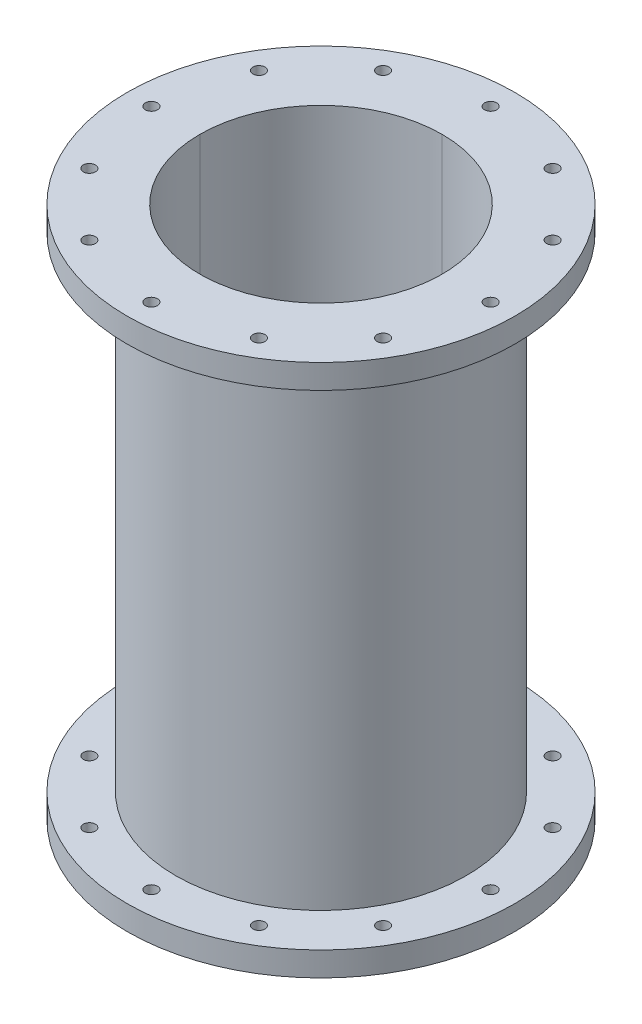
ISO-10303-21;
HEADER;
FILE_DESCRIPTION(('STEP AP214'),'2;1');
FILE_NAME('part.step','',(''),(''),'','','');
FILE_SCHEMA(('AUTOMOTIVE_DESIGN { 1 0 10303 214 1 1 1 1 }'));
ENDSEC;
DATA;
#1=APPLICATION_CONTEXT('core data for automotive mechanical design processes');
#2=APPLICATION_PROTOCOL_DEFINITION('international standard','automotive_design',2000,#1);
#3=PRODUCT_CONTEXT('',#1,'mechanical');
#4=PRODUCT('Part','Part','',(#3));
#5=PRODUCT_RELATED_PRODUCT_CATEGORY('part','',(#4));
#6=PRODUCT_DEFINITION_FORMATION('','',#4);
#7=PRODUCT_DEFINITION_CONTEXT('part definition',#1,'design');
#8=PRODUCT_DEFINITION('design','',#6,#7);
#9=PRODUCT_DEFINITION_SHAPE('','',#8);
#10=(LENGTH_UNIT() NAMED_UNIT(*) SI_UNIT(.MILLI.,.METRE.));
#11=(NAMED_UNIT(*) PLANE_ANGLE_UNIT() SI_UNIT($,.RADIAN.));
#12=(NAMED_UNIT(*) SI_UNIT($,.STERADIAN.) SOLID_ANGLE_UNIT());
#13=UNCERTAINTY_MEASURE_WITH_UNIT(LENGTH_MEASURE(1.E-05),#10,'distance_accuracy_value','');
#14=(GEOMETRIC_REPRESENTATION_CONTEXT(3) GLOBAL_UNCERTAINTY_ASSIGNED_CONTEXT((#13)) GLOBAL_UNIT_ASSIGNED_CONTEXT((#10,
#11,#12)) REPRESENTATION_CONTEXT('',''));
#15=CARTESIAN_POINT('',(0.,0.,0.));
#16=DIRECTION('',(0.,0.,1.));
#17=DIRECTION('',(1.,0.,0.));
#18=AXIS2_PLACEMENT_3D('',#15,#16,#17);
#19=CARTESIAN_POINT('',(76.9896583964555,139.7,44.4499999999891));
#20=DIRECTION('',(0.,-1.,0.));
#21=DIRECTION('',(0.,0.,-1.));
#22=AXIS2_PLACEMENT_3D('',#19,#20,#21);
#23=CYLINDRICAL_SURFACE('',#22,3.17500000001532);
#24=CARTESIAN_POINT('',(76.9896583964555,-139.7,44.4499999999891));
#25=DIRECTION('',(0.,1.,0.));
#26=DIRECTION('',(0.,0.,1.));
#27=AXIS2_PLACEMENT_3D('',#24,#25,#26);
#28=CIRCLE('',#27,3.17500000001532);
#29=CARTESIAN_POINT('',(76.9896583964555,-139.7,47.6250000000044));
#30=VERTEX_POINT('',#29);
#31=EDGE_CURVE('E157',#30,#30,#28,.T.);
#32=ORIENTED_EDGE('',*,*,#31,.F.);
#33=EDGE_LOOP('',(#32));
#34=FACE_BOUND('',#33,.T.);
#35=CARTESIAN_POINT('',(76.9896583964555,-127.,44.4499999999891));
#36=DIRECTION('',(0.,1.,0.));
#37=DIRECTION('',(0.,0.,1.));
#38=AXIS2_PLACEMENT_3D('',#35,#36,#37);
#39=CIRCLE('',#38,3.17500000001532);
#40=CARTESIAN_POINT('',(76.9896583964555,-127.,47.6250000000044));
#41=VERTEX_POINT('',#40);
#42=EDGE_CURVE('E249',#41,#41,#39,.T.);
#43=ORIENTED_EDGE('',*,*,#42,.T.);
#44=EDGE_LOOP('',(#43));
#45=FACE_BOUND('',#44,.T.);
#46=ADVANCED_FACE('F48',(#34,#45),#23,.F.);
#47=CARTESIAN_POINT('',(44.4500000000236,139.7,76.9896583964303));
#48=DIRECTION('',(0.,-1.,0.));
#49=DIRECTION('',(0.,0.,-1.));
#50=AXIS2_PLACEMENT_3D('',#47,#48,#49);
#51=CYLINDRICAL_SURFACE('',#50,3.17500000002121);
#52=CARTESIAN_POINT('',(44.4500000000236,-139.7,76.9896583964303));
#53=DIRECTION('',(0.,1.,0.));
#54=DIRECTION('',(0.,0.,1.));
#55=AXIS2_PLACEMENT_3D('',#52,#53,#54);
#56=CIRCLE('',#55,3.17500000002121);
#57=CARTESIAN_POINT('',(44.4500000000236,-139.7,80.1646583964515));
#58=VERTEX_POINT('',#57);
#59=EDGE_CURVE('E153',#58,#58,#56,.T.);
#60=ORIENTED_EDGE('',*,*,#59,.F.);
#61=EDGE_LOOP('',(#60));
#62=FACE_BOUND('',#61,.T.);
#63=CARTESIAN_POINT('',(44.4500000000236,-127.,76.9896583964303));
#64=DIRECTION('',(0.,1.,0.));
#65=DIRECTION('',(0.,0.,1.));
#66=AXIS2_PLACEMENT_3D('',#63,#64,#65);
#67=CIRCLE('',#66,3.1750000000212);
#68=CARTESIAN_POINT('',(44.4500000000236,-127.,80.1646583964515));
#69=VERTEX_POINT('',#68);
#70=EDGE_CURVE('E474',#69,#69,#67,.T.);
#71=ORIENTED_EDGE('',*,*,#70,.T.);
#72=EDGE_LOOP('',(#71));
#73=FACE_BOUND('',#72,.T.);
#74=ADVANCED_FACE('F184',(#62,#73),#51,.F.);
#75=CARTESIAN_POINT('',(88.9,139.7,0.));
#76=DIRECTION('',(0.,-1.,0.));
#77=DIRECTION('',(0.,0.,-1.));
#78=AXIS2_PLACEMENT_3D('',#75,#76,#77);
#79=CYLINDRICAL_SURFACE('',#78,3.175);
#80=CARTESIAN_POINT('',(88.9,-139.7,0.));
#81=DIRECTION('',(0.,1.,0.));
#82=DIRECTION('',(0.,0.,1.));
#83=AXIS2_PLACEMENT_3D('',#80,#81,#82);
#84=CIRCLE('',#83,3.175);
#85=CARTESIAN_POINT('',(88.9,-139.7,3.175));
#86=VERTEX_POINT('',#85);
#87=EDGE_CURVE('E147',#86,#86,#84,.T.);
#88=ORIENTED_EDGE('',*,*,#87,.F.);
#89=EDGE_LOOP('',(#88));
#90=FACE_BOUND('',#89,.T.);
#91=CARTESIAN_POINT('',(88.9,-127.,0.));
#92=DIRECTION('',(0.,1.,0.));
#93=DIRECTION('',(0.,0.,1.));
#94=AXIS2_PLACEMENT_3D('',#91,#92,#93);
#95=CIRCLE('',#94,3.175);
#96=CARTESIAN_POINT('',(88.9,-127.,3.175));
#97=VERTEX_POINT('',#96);
#98=EDGE_CURVE('E240',#97,#97,#95,.T.);
#99=ORIENTED_EDGE('',*,*,#98,.T.);
#100=EDGE_LOOP('',(#99));
#101=FACE_BOUND('',#100,.T.);
#102=ADVANCED_FACE('F190',(#90,#101),#79,.F.);
#103=CARTESIAN_POINT('',(44.4500000000017,139.7,-76.9896583964429));
#104=DIRECTION('',(0.,-1.,0.));
#105=DIRECTION('',(0.,0.,-1.));
#106=AXIS2_PLACEMENT_3D('',#103,#104,#105);
#107=CYLINDRICAL_SURFACE('',#106,3.17499999999983);
#108=CARTESIAN_POINT('',(44.4500000000017,-139.7,-76.9896583964429));
#109=DIRECTION('',(0.,1.,0.));
#110=DIRECTION('',(0.,0.,1.));
#111=AXIS2_PLACEMENT_3D('',#108,#109,#110);
#112=CIRCLE('',#111,3.17499999999983);
#113=CARTESIAN_POINT('',(44.4500000000017,-139.7,-73.8146583964431));
#114=VERTEX_POINT('',#113);
#115=EDGE_CURVE('E143',#114,#114,#112,.T.);
#116=ORIENTED_EDGE('',*,*,#115,.F.);
#117=EDGE_LOOP('',(#116));
#118=FACE_BOUND('',#117,.T.);
#119=CARTESIAN_POINT('',(44.4500000000017,-127.,-76.9896583964429));
#120=DIRECTION('',(0.,1.,0.));
#121=DIRECTION('',(0.,0.,1.));
#122=AXIS2_PLACEMENT_3D('',#119,#120,#121);
#123=CIRCLE('',#122,3.17499999999983);
#124=CARTESIAN_POINT('',(44.4500000000017,-127.,-73.8146583964431));
#125=VERTEX_POINT('',#124);
#126=EDGE_CURVE('E239',#125,#125,#123,.T.);
#127=ORIENTED_EDGE('',*,*,#126,.T.);
#128=EDGE_LOOP('',(#127));
#129=FACE_BOUND('',#128,.T.);
#130=ADVANCED_FACE('F374',(#118,#129),#107,.F.);
#131=CARTESIAN_POINT('',(-44.4499999999764,139.7,76.9896583964429));
#132=DIRECTION('',(0.,-1.,0.));
#133=DIRECTION('',(0.,0.,-1.));
#134=AXIS2_PLACEMENT_3D('',#131,#132,#133);
#135=CYLINDRICAL_SURFACE('',#134,3.17500000002509);
#136=CARTESIAN_POINT('',(-44.4499999999764,-139.7,76.9896583964429));
#137=DIRECTION('',(0.,1.,0.));
#138=DIRECTION('',(0.,0.,1.));
#139=AXIS2_PLACEMENT_3D('',#136,#137,#138);
#140=CIRCLE('',#139,3.17500000002509);
#141=CARTESIAN_POINT('',(-44.4499999999764,-139.7,80.164658396468));
#142=VERTEX_POINT('',#141);
#143=EDGE_CURVE('E139',#142,#142,#140,.T.);
#144=ORIENTED_EDGE('',*,*,#143,.F.);
#145=EDGE_LOOP('',(#144));
#146=FACE_BOUND('',#145,.T.);
#147=CARTESIAN_POINT('',(-44.4499999999764,-127.,76.9896583964429));
#148=DIRECTION('',(0.,1.,0.));
#149=DIRECTION('',(0.,0.,1.));
#150=AXIS2_PLACEMENT_3D('',#147,#148,#149);
#151=CIRCLE('',#150,3.17500000002509);
#152=CARTESIAN_POINT('',(-44.4499999999764,-127.,80.164658396468));
#153=VERTEX_POINT('',#152);
#154=EDGE_CURVE('E464',#153,#153,#151,.T.);
#155=ORIENTED_EDGE('',*,*,#154,.T.);
#156=EDGE_LOOP('',(#155));
#157=FACE_BOUND('',#156,.T.);
#158=ADVANCED_FACE('F381',(#146,#157),#135,.F.);
#159=CARTESIAN_POINT('',(-76.9896583964177,139.7,44.450000000011));
#160=DIRECTION('',(0.,-1.,0.));
#161=DIRECTION('',(0.,0.,-1.));
#162=AXIS2_PLACEMENT_3D('',#159,#160,#161);
#163=CYLINDRICAL_SURFACE('',#162,3.1750000000221);
#164=CARTESIAN_POINT('',(-76.9896583964177,-139.7,44.450000000011));
#165=DIRECTION('',(0.,1.,0.));
#166=DIRECTION('',(0.,0.,1.));
#167=AXIS2_PLACEMENT_3D('',#164,#165,#166);
#168=CIRCLE('',#167,3.1750000000221);
#169=CARTESIAN_POINT('',(-76.9896583964177,-139.7,47.6250000000331));
#170=VERTEX_POINT('',#169);
#171=EDGE_CURVE('E135',#170,#170,#168,.T.);
#172=ORIENTED_EDGE('',*,*,#171,.F.);
#173=EDGE_LOOP('',(#172));
#174=FACE_BOUND('',#173,.T.);
#175=CARTESIAN_POINT('',(-76.9896583964177,-127.,44.450000000011));
#176=DIRECTION('',(0.,1.,0.));
#177=DIRECTION('',(0.,0.,1.));
#178=AXIS2_PLACEMENT_3D('',#175,#176,#177);
#179=CIRCLE('',#178,3.1750000000221);
#180=CARTESIAN_POINT('',(-76.9896583964177,-127.,47.6250000000331));
#181=VERTEX_POINT('',#180);
#182=EDGE_CURVE('E468',#181,#181,#179,.T.);
#183=ORIENTED_EDGE('',*,*,#182,.T.);
#184=EDGE_LOOP('',(#183));
#185=FACE_BOUND('',#184,.T.);
#186=ADVANCED_FACE('F452',(#174,#185),#163,.F.);
#187=CARTESIAN_POINT('',(2.52342383534959E-11,139.7,88.9));
#188=DIRECTION('',(0.,-1.,0.));
#189=DIRECTION('',(0.,0.,-1.));
#190=AXIS2_PLACEMENT_3D('',#187,#188,#189);
#191=CYLINDRICAL_SURFACE('',#190,3.17500000002472);
#192=CARTESIAN_POINT('',(2.52342383534959E-11,-139.7,88.9));
#193=DIRECTION('',(0.,1.,0.));
#194=DIRECTION('',(0.,0.,1.));
#195=AXIS2_PLACEMENT_3D('',#192,#193,#194);
#196=CIRCLE('',#195,3.17500000002472);
#197=CARTESIAN_POINT('',(2.52342383534959E-11,-139.7,92.0750000000247));
#198=VERTEX_POINT('',#197);
#199=EDGE_CURVE('E131',#198,#198,#196,.T.);
#200=ORIENTED_EDGE('',*,*,#199,.F.);
#201=EDGE_LOOP('',(#200));
#202=FACE_BOUND('',#201,.T.);
#203=CARTESIAN_POINT('',(2.52342383534959E-11,-127.,88.9));
#204=DIRECTION('',(0.,1.,0.));
#205=DIRECTION('',(0.,0.,1.));
#206=AXIS2_PLACEMENT_3D('',#203,#204,#205);
#207=CIRCLE('',#206,3.17500000002473);
#208=CARTESIAN_POINT('',(2.52342383534959E-11,-127.,92.0750000000247));
#209=VERTEX_POINT('',#208);
#210=EDGE_CURVE('E467',#209,#209,#207,.T.);
#211=ORIENTED_EDGE('',*,*,#210,.T.);
#212=EDGE_LOOP('',(#211));
#213=FACE_BOUND('',#212,.T.);
#214=ADVANCED_FACE('F417',(#202,#213),#191,.F.);
#215=CARTESIAN_POINT('',(-44.4499999999983,139.7,-76.9896583964303));
#216=DIRECTION('',(0.,-1.,0.));
#217=DIRECTION('',(0.,0.,-1.));
#218=AXIS2_PLACEMENT_3D('',#215,#216,#217);
#219=CYLINDRICAL_SURFACE('',#218,3.17500000000459);
#220=CARTESIAN_POINT('',(-44.4499999999983,-139.7,-76.9896583964303));
#221=DIRECTION('',(0.,1.,0.));
#222=DIRECTION('',(0.,0.,1.));
#223=AXIS2_PLACEMENT_3D('',#220,#221,#222);
#224=CIRCLE('',#223,3.17500000000459);
#225=CARTESIAN_POINT('',(-44.4499999999983,-139.7,-73.8146583964257));
#226=VERTEX_POINT('',#225);
#227=EDGE_CURVE('E127',#226,#226,#224,.T.);
#228=ORIENTED_EDGE('',*,*,#227,.F.);
#229=EDGE_LOOP('',(#228));
#230=FACE_BOUND('',#229,.T.);
#231=CARTESIAN_POINT('',(-44.4499999999983,-127.,-76.9896583964303));
#232=DIRECTION('',(0.,1.,0.));
#233=DIRECTION('',(0.,0.,1.));
#234=AXIS2_PLACEMENT_3D('',#231,#232,#233);
#235=CIRCLE('',#234,3.17500000000459);
#236=CARTESIAN_POINT('',(-44.4499999999983,-127.,-73.8146583964257));
#237=VERTEX_POINT('',#236);
#238=EDGE_CURVE('E320',#237,#237,#235,.T.);
#239=ORIENTED_EDGE('',*,*,#238,.T.);
#240=EDGE_LOOP('',(#239));
#241=FACE_BOUND('',#240,.T.);
#242=ADVANCED_FACE('F406',(#230,#241),#219,.F.);
#243=CARTESIAN_POINT('',(0.,139.7,0.));
#244=DIRECTION('',(0.,-1.,0.));
#245=DIRECTION('',(0.,0.,-1.));
#246=AXIS2_PLACEMENT_3D('',#243,#244,#245);
#247=CYLINDRICAL_SURFACE('',#246,101.6);
#248=CARTESIAN_POINT('',(0.,-139.7,0.));
#249=DIRECTION('',(0.,1.,0.));
#250=DIRECTION('',(0.,0.,1.));
#251=AXIS2_PLACEMENT_3D('',#248,#249,#250);
#252=CIRCLE('',#251,101.6);
#253=CARTESIAN_POINT('',(0.,-139.7,101.6));
#254=VERTEX_POINT('',#253);
#255=EDGE_CURVE('E123',#254,#254,#252,.T.);
#256=ORIENTED_EDGE('',*,*,#255,.T.);
#257=EDGE_LOOP('',(#256));
#258=FACE_BOUND('',#257,.T.);
#259=CARTESIAN_POINT('',(0.,-127.,0.));
#260=DIRECTION('',(0.,1.,0.));
#261=DIRECTION('',(0.,0.,1.));
#262=AXIS2_PLACEMENT_3D('',#259,#260,#261);
#263=CIRCLE('',#262,101.6);
#264=CARTESIAN_POINT('',(0.,-127.,101.6));
#265=VERTEX_POINT('',#264);
#266=EDGE_CURVE('E79',#265,#265,#263,.T.);
#267=ORIENTED_EDGE('',*,*,#266,.F.);
#268=EDGE_LOOP('',(#267));
#269=FACE_BOUND('',#268,.T.);
#270=ADVANCED_FACE('F403',(#258,#269),#247,.T.);
#271=CARTESIAN_POINT('',(-76.9896583964303,139.7,-44.449999999989));
#272=DIRECTION('',(0.,-1.,0.));
#273=DIRECTION('',(0.,0.,-1.));
#274=AXIS2_PLACEMENT_3D('',#271,#272,#273);
#275=CYLINDRICAL_SURFACE('',#274,3.17500000001029);
#276=CARTESIAN_POINT('',(-76.9896583964303,-139.7,-44.449999999989));
#277=DIRECTION('',(0.,1.,0.));
#278=DIRECTION('',(0.,0.,1.));
#279=AXIS2_PLACEMENT_3D('',#276,#277,#278);
#280=CIRCLE('',#279,3.17500000001029);
#281=CARTESIAN_POINT('',(-76.9896583964303,-139.7,-41.2749999999787));
#282=VERTEX_POINT('',#281);
#283=EDGE_CURVE('E119',#282,#282,#280,.T.);
#284=ORIENTED_EDGE('',*,*,#283,.F.);
#285=EDGE_LOOP('',(#284));
#286=FACE_BOUND('',#285,.T.);
#287=CARTESIAN_POINT('',(-76.9896583964303,-127.,-44.449999999989));
#288=DIRECTION('',(0.,1.,0.));
#289=DIRECTION('',(0.,0.,1.));
#290=AXIS2_PLACEMENT_3D('',#287,#288,#289);
#291=CIRCLE('',#290,3.17500000001029);
#292=CARTESIAN_POINT('',(-76.9896583964303,-127.,-41.2749999999787));
#293=VERTEX_POINT('',#292);
#294=EDGE_CURVE('E246',#293,#293,#291,.T.);
#295=ORIENTED_EDGE('',*,*,#294,.T.);
#296=EDGE_LOOP('',(#295));
#297=FACE_BOUND('',#296,.T.);
#298=ADVANCED_FACE('F405',(#286,#297),#275,.F.);
#299=CARTESIAN_POINT('',(0.,139.7,-88.9));
#300=DIRECTION('',(0.,-1.,0.));
#301=DIRECTION('',(0.,0.,-1.));
#302=AXIS2_PLACEMENT_3D('',#299,#300,#301);
#303=CYLINDRICAL_SURFACE('',#302,3.175);
#304=CARTESIAN_POINT('',(0.,-139.7,-88.9));
#305=DIRECTION('',(0.,1.,0.));
#306=DIRECTION('',(0.,0.,1.));
#307=AXIS2_PLACEMENT_3D('',#304,#305,#306);
#308=CIRCLE('',#307,3.175);
#309=CARTESIAN_POINT('',(0.,-139.7,-85.725));
#310=VERTEX_POINT('',#309);
#311=EDGE_CURVE('E115',#310,#310,#308,.T.);
#312=ORIENTED_EDGE('',*,*,#311,.F.);
#313=EDGE_LOOP('',(#312));
#314=FACE_BOUND('',#313,.T.);
#315=CARTESIAN_POINT('',(0.,-127.,-88.9));
#316=DIRECTION('',(0.,1.,0.));
#317=DIRECTION('',(0.,0.,1.));
#318=AXIS2_PLACEMENT_3D('',#315,#316,#317);
#319=CIRCLE('',#318,3.175);
#320=CARTESIAN_POINT('',(0.,-127.,-85.725));
#321=VERTEX_POINT('',#320);
#322=EDGE_CURVE('E256',#321,#321,#319,.T.);
#323=ORIENTED_EDGE('',*,*,#322,.T.);
#324=EDGE_LOOP('',(#323));
#325=FACE_BOUND('',#324,.T.);
#326=ADVANCED_FACE('F230',(#314,#325),#303,.F.);
#327=CARTESIAN_POINT('',(-88.8999999999874,139.7,1.26280062867924E-11));
#328=DIRECTION('',(0.,-1.,0.));
#329=DIRECTION('',(0.,0.,-1.));
#330=AXIS2_PLACEMENT_3D('',#327,#328,#329);
#331=CYLINDRICAL_SURFACE('',#330,3.17500000001666);
#332=CARTESIAN_POINT('',(-88.8999999999874,-139.7,1.26280062867924E-11));
#333=DIRECTION('',(0.,1.,0.));
#334=DIRECTION('',(0.,0.,1.));
#335=AXIS2_PLACEMENT_3D('',#332,#333,#334);
#336=CIRCLE('',#335,3.17500000001666);
#337=CARTESIAN_POINT('',(-88.8999999999874,-139.7,3.17500000002928));
#338=VERTEX_POINT('',#337);
#339=EDGE_CURVE('E78',#338,#338,#336,.T.);
#340=ORIENTED_EDGE('',*,*,#339,.F.);
#341=EDGE_LOOP('',(#340));
#342=FACE_BOUND('',#341,.T.);
#343=CARTESIAN_POINT('',(-88.8999999999874,-127.,1.26280062867924E-11));
#344=DIRECTION('',(0.,1.,0.));
#345=DIRECTION('',(0.,0.,1.));
#346=AXIS2_PLACEMENT_3D('',#343,#344,#345);
#347=CIRCLE('',#346,3.17500000001666);
#348=CARTESIAN_POINT('',(-88.8999999999874,-127.,3.17500000002928));
#349=VERTEX_POINT('',#348);
#350=EDGE_CURVE('E477',#349,#349,#347,.T.);
#351=ORIENTED_EDGE('',*,*,#350,.T.);
#352=EDGE_LOOP('',(#351));
#353=FACE_BOUND('',#352,.T.);
#354=ADVANCED_FACE('F223',(#342,#353),#331,.F.);
#355=CARTESIAN_POINT('',(76.9896583964429,139.7,-44.4500000000109));
#356=DIRECTION('',(0.,-1.,0.));
#357=DIRECTION('',(0.,0.,-1.));
#358=AXIS2_PLACEMENT_3D('',#355,#356,#357);
#359=CYLINDRICAL_SURFACE('',#358,3.17500000000305);
#360=CARTESIAN_POINT('',(76.9896583964429,-139.7,-44.4500000000109));
#361=DIRECTION('',(0.,1.,0.));
#362=DIRECTION('',(0.,0.,1.));
#363=AXIS2_PLACEMENT_3D('',#360,#361,#362);
#364=CIRCLE('',#363,3.17500000000305);
#365=CARTESIAN_POINT('',(76.9896583964429,-139.7,-41.2750000000079));
#366=VERTEX_POINT('',#365);
#367=EDGE_CURVE('E161',#366,#366,#364,.T.);
#368=ORIENTED_EDGE('',*,*,#367,.F.);
#369=EDGE_LOOP('',(#368));
#370=FACE_BOUND('',#369,.T.);
#371=CARTESIAN_POINT('',(76.9896583964429,-127.,-44.4500000000109));
#372=DIRECTION('',(0.,1.,0.));
#373=DIRECTION('',(0.,0.,1.));
#374=AXIS2_PLACEMENT_3D('',#371,#372,#373);
#375=CIRCLE('',#374,3.17500000000305);
#376=CARTESIAN_POINT('',(76.9896583964429,-127.,-41.2750000000079));
#377=VERTEX_POINT('',#376);
#378=EDGE_CURVE('E236',#377,#377,#375,.T.);
#379=ORIENTED_EDGE('',*,*,#378,.T.);
#380=EDGE_LOOP('',(#379));
#381=FACE_BOUND('',#380,.T.);
#382=ADVANCED_FACE('F178',(#370,#381),#359,.F.);
#383=CARTESIAN_POINT('',(0.,139.7,0.));
#384=DIRECTION('',(0.,1.,0.));
#385=DIRECTION('',(0.,0.,1.));
#386=AXIS2_PLACEMENT_3D('',#383,#384,#385);
#387=PLANE('',#386);
#388=CARTESIAN_POINT('',(-88.8999999999874,139.7,1.26280062867924E-11));
#389=DIRECTION('',(0.,1.,0.));
#390=DIRECTION('',(0.,0.,1.));
#391=AXIS2_PLACEMENT_3D('',#388,#389,#390);
#392=CIRCLE('',#391,3.17500000001666);
#393=CARTESIAN_POINT('',(-88.8999999999874,139.7,3.17500000002928));
#394=VERTEX_POINT('',#393);
#395=EDGE_CURVE('E164',#394,#394,#392,.T.);
#396=ORIENTED_EDGE('',*,*,#395,.F.);
#397=EDGE_LOOP('',(#396));
#398=FACE_BOUND('',#397,.T.);
#399=CARTESIAN_POINT('',(0.,139.7,-88.9));
#400=DIRECTION('',(0.,1.,0.));
#401=DIRECTION('',(0.,0.,1.));
#402=AXIS2_PLACEMENT_3D('',#399,#400,#401);
#403=CIRCLE('',#402,3.175);
#404=CARTESIAN_POINT('',(0.,139.7,-85.725));
#405=VERTEX_POINT('',#404);
#406=EDGE_CURVE('E325',#405,#405,#403,.T.);
#407=ORIENTED_EDGE('',*,*,#406,.F.);
#408=EDGE_LOOP('',(#407));
#409=FACE_BOUND('',#408,.T.);
#410=CARTESIAN_POINT('',(-76.9896583964303,139.7,-44.449999999989));
#411=DIRECTION('',(0.,1.,0.));
#412=DIRECTION('',(0.,0.,1.));
#413=AXIS2_PLACEMENT_3D('',#410,#411,#412);
#414=CIRCLE('',#413,3.17500000001029);
#415=CARTESIAN_POINT('',(-76.9896583964303,139.7,-41.2749999999787));
#416=VERTEX_POINT('',#415);
#417=EDGE_CURVE('E329',#416,#416,#414,.T.);
#418=ORIENTED_EDGE('',*,*,#417,.F.);
#419=EDGE_LOOP('',(#418));
#420=FACE_BOUND('',#419,.T.);
#421=CARTESIAN_POINT('',(0.,139.7,0.));
#422=DIRECTION('',(0.,1.,0.));
#423=DIRECTION('',(0.,0.,1.));
#424=AXIS2_PLACEMENT_3D('',#421,#422,#423);
#425=CIRCLE('',#424,101.6);
#426=CARTESIAN_POINT('',(0.,139.7,101.6));
#427=VERTEX_POINT('',#426);
#428=EDGE_CURVE('E333',#427,#427,#425,.T.);
#429=ORIENTED_EDGE('',*,*,#428,.T.);
#430=EDGE_LOOP('',(#429));
#431=FACE_BOUND('',#430,.T.);
#432=CARTESIAN_POINT('',(-44.4499999999983,139.7,-76.9896583964303));
#433=DIRECTION('',(0.,1.,0.));
#434=DIRECTION('',(0.,0.,1.));
#435=AXIS2_PLACEMENT_3D('',#432,#433,#434);
#436=CIRCLE('',#435,3.17500000000459);
#437=CARTESIAN_POINT('',(-44.4499999999983,139.7,-73.8146583964257));
#438=VERTEX_POINT('',#437);
#439=EDGE_CURVE('E337',#438,#438,#436,.T.);
#440=ORIENTED_EDGE('',*,*,#439,.F.);
#441=EDGE_LOOP('',(#440));
#442=FACE_BOUND('',#441,.T.);
#443=CARTESIAN_POINT('',(2.52342383534959E-11,139.7,88.9));
#444=DIRECTION('',(0.,1.,0.));
#445=DIRECTION('',(0.,0.,1.));
#446=AXIS2_PLACEMENT_3D('',#443,#444,#445);
#447=CIRCLE('',#446,3.17500000002472);
#448=CARTESIAN_POINT('',(2.52342383534959E-11,139.7,92.0750000000247));
#449=VERTEX_POINT('',#448);
#450=EDGE_CURVE('E341',#449,#449,#447,.T.);
#451=ORIENTED_EDGE('',*,*,#450,.F.);
#452=EDGE_LOOP('',(#451));
#453=FACE_BOUND('',#452,.T.);
#454=CARTESIAN_POINT('',(-76.9896583964177,139.7,44.450000000011));
#455=DIRECTION('',(0.,1.,0.));
#456=DIRECTION('',(0.,0.,1.));
#457=AXIS2_PLACEMENT_3D('',#454,#455,#456);
#458=CIRCLE('',#457,3.1750000000221);
#459=CARTESIAN_POINT('',(-76.9896583964177,139.7,47.6250000000331));
#460=VERTEX_POINT('',#459);
#461=EDGE_CURVE('E345',#460,#460,#458,.T.);
#462=ORIENTED_EDGE('',*,*,#461,.F.);
#463=EDGE_LOOP('',(#462));
#464=FACE_BOUND('',#463,.T.);
#465=CARTESIAN_POINT('',(-44.4499999999764,139.7,76.9896583964429));
#466=DIRECTION('',(0.,1.,0.));
#467=DIRECTION('',(0.,0.,1.));
#468=AXIS2_PLACEMENT_3D('',#465,#466,#467);
#469=CIRCLE('',#468,3.17500000002509);
#470=CARTESIAN_POINT('',(-44.4499999999764,139.7,80.164658396468));
#471=VERTEX_POINT('',#470);
#472=EDGE_CURVE('E349',#471,#471,#469,.T.);
#473=ORIENTED_EDGE('',*,*,#472,.F.);
#474=EDGE_LOOP('',(#473));
#475=FACE_BOUND('',#474,.T.);
#476=CARTESIAN_POINT('',(44.4500000000017,139.7,-76.9896583964429));
#477=DIRECTION('',(0.,1.,0.));
#478=DIRECTION('',(0.,0.,1.));
#479=AXIS2_PLACEMENT_3D('',#476,#477,#478);
#480=CIRCLE('',#479,3.17499999999983);
#481=CARTESIAN_POINT('',(44.4500000000017,139.7,-73.8146583964431));
#482=VERTEX_POINT('',#481);
#483=EDGE_CURVE('E102',#482,#482,#480,.T.);
#484=ORIENTED_EDGE('',*,*,#483,.F.);
#485=EDGE_LOOP('',(#484));
#486=FACE_BOUND('',#485,.T.);
#487=CARTESIAN_POINT('',(88.9,139.7,0.));
#488=DIRECTION('',(0.,1.,0.));
#489=DIRECTION('',(0.,0.,1.));
#490=AXIS2_PLACEMENT_3D('',#487,#488,#489);
#491=CIRCLE('',#490,3.175);
#492=CARTESIAN_POINT('',(88.9,139.7,3.175));
#493=VERTEX_POINT('',#492);
#494=EDGE_CURVE('E93',#493,#493,#491,.T.);
#495=ORIENTED_EDGE('',*,*,#494,.F.);
#496=EDGE_LOOP('',(#495));
#497=FACE_BOUND('',#496,.T.);
#498=CARTESIAN_POINT('',(44.4500000000236,139.7,76.9896583964303));
#499=DIRECTION('',(0.,1.,0.));
#500=DIRECTION('',(0.,0.,1.));
#501=AXIS2_PLACEMENT_3D('',#498,#499,#500);
#502=CIRCLE('',#501,3.17500000002121);
#503=CARTESIAN_POINT('',(44.4500000000236,139.7,80.1646583964515));
#504=VERTEX_POINT('',#503);
#505=EDGE_CURVE('E92',#504,#504,#502,.T.);
#506=ORIENTED_EDGE('',*,*,#505,.F.);
#507=EDGE_LOOP('',(#506));
#508=FACE_BOUND('',#507,.T.);
#509=CARTESIAN_POINT('',(76.9896583964555,139.7,44.4499999999891));
#510=DIRECTION('',(0.,1.,0.));
#511=DIRECTION('',(0.,0.,1.));
#512=AXIS2_PLACEMENT_3D('',#509,#510,#511);
#513=CIRCLE('',#512,3.17500000001532);
#514=CARTESIAN_POINT('',(76.9896583964555,139.7,47.6250000000044));
#515=VERTEX_POINT('',#514);
#516=EDGE_CURVE('E99',#515,#515,#513,.T.);
#517=ORIENTED_EDGE('',*,*,#516,.F.);
#518=EDGE_LOOP('',(#517));
#519=FACE_BOUND('',#518,.T.);
#520=CARTESIAN_POINT('',(76.9896583964429,139.7,-44.4500000000109));
#521=DIRECTION('',(0.,1.,0.));
#522=DIRECTION('',(0.,0.,1.));
#523=AXIS2_PLACEMENT_3D('',#520,#521,#522);
#524=CIRCLE('',#523,3.17500000000305);
#525=CARTESIAN_POINT('',(76.9896583964429,139.7,-41.2750000000079));
#526=VERTEX_POINT('',#525);
#527=EDGE_CURVE('E88',#526,#526,#524,.T.);
#528=ORIENTED_EDGE('',*,*,#527,.F.);
#529=EDGE_LOOP('',(#528));
#530=FACE_BOUND('',#529,.T.);
#531=CARTESIAN_POINT('',(0.,139.7,0.));
#532=DIRECTION('',(0.,1.,0.));
#533=DIRECTION('',(0.,0.,1.));
#534=AXIS2_PLACEMENT_3D('',#531,#532,#533);
#535=CIRCLE('',#534,63.5);
#536=CARTESIAN_POINT('',(0.,139.7,-63.5));
#537=VERTEX_POINT('',#536);
#538=CARTESIAN_POINT('',(-63.5,139.7,0.));
#539=VERTEX_POINT('',#538);
#540=EDGE_CURVE('E84',#537,#539,#535,.T.);
#541=ORIENTED_EDGE('',*,*,#540,.F.);
#542=CARTESIAN_POINT('',(0.,139.7,0.));
#543=DIRECTION('',(0.,1.,0.));
#544=DIRECTION('',(0.,0.,1.));
#545=AXIS2_PLACEMENT_3D('',#542,#543,#544);
#546=CIRCLE('',#545,63.5);
#547=EDGE_CURVE('E72',#539,#537,#546,.T.);
#548=ORIENTED_EDGE('',*,*,#547,.F.);
#549=EDGE_LOOP('',(#541,#548));
#550=FACE_BOUND('',#549,.T.);
#551=ADVANCED_FACE('F90',(#398,#409,#420,#431,#442,#453,#464,#475,#486,#497,#508,#519,#530,
#550),#387,.T.);
#552=CARTESIAN_POINT('',(0.,-139.7,0.));
#553=DIRECTION('',(0.,1.,0.));
#554=DIRECTION('',(0.,0.,1.));
#555=AXIS2_PLACEMENT_3D('',#552,#553,#554);
#556=PLANE('',#555);
#557=ORIENTED_EDGE('',*,*,#367,.T.);
#558=EDGE_LOOP('',(#557));
#559=FACE_BOUND('',#558,.T.);
#560=ORIENTED_EDGE('',*,*,#31,.T.);
#561=EDGE_LOOP('',(#560));
#562=FACE_BOUND('',#561,.T.);
#563=ORIENTED_EDGE('',*,*,#59,.T.);
#564=EDGE_LOOP('',(#563));
#565=FACE_BOUND('',#564,.T.);
#566=ORIENTED_EDGE('',*,*,#87,.T.);
#567=EDGE_LOOP('',(#566));
#568=FACE_BOUND('',#567,.T.);
#569=ORIENTED_EDGE('',*,*,#115,.T.);
#570=EDGE_LOOP('',(#569));
#571=FACE_BOUND('',#570,.T.);
#572=ORIENTED_EDGE('',*,*,#143,.T.);
#573=EDGE_LOOP('',(#572));
#574=FACE_BOUND('',#573,.T.);
#575=ORIENTED_EDGE('',*,*,#171,.T.);
#576=EDGE_LOOP('',(#575));
#577=FACE_BOUND('',#576,.T.);
#578=ORIENTED_EDGE('',*,*,#199,.T.);
#579=EDGE_LOOP('',(#578));
#580=FACE_BOUND('',#579,.T.);
#581=ORIENTED_EDGE('',*,*,#227,.T.);
#582=EDGE_LOOP('',(#581));
#583=FACE_BOUND('',#582,.T.);
#584=ORIENTED_EDGE('',*,*,#255,.F.);
#585=EDGE_LOOP('',(#584));
#586=FACE_BOUND('',#585,.T.);
#587=ORIENTED_EDGE('',*,*,#283,.T.);
#588=EDGE_LOOP('',(#587));
#589=FACE_BOUND('',#588,.T.);
#590=ORIENTED_EDGE('',*,*,#311,.T.);
#591=EDGE_LOOP('',(#590));
#592=FACE_BOUND('',#591,.T.);
#593=ORIENTED_EDGE('',*,*,#339,.T.);
#594=EDGE_LOOP('',(#593));
#595=FACE_BOUND('',#594,.T.);
#596=CARTESIAN_POINT('',(0.,-139.7,0.));
#597=DIRECTION('',(0.,1.,0.));
#598=DIRECTION('',(0.,0.,1.));
#599=AXIS2_PLACEMENT_3D('',#596,#597,#598);
#600=CIRCLE('',#599,63.5);
#601=CARTESIAN_POINT('',(0.,-139.7,-63.5));
#602=VERTEX_POINT('',#601);
#603=CARTESIAN_POINT('',(-63.5,-139.7,0.));
#604=VERTEX_POINT('',#603);
#605=EDGE_CURVE('E12',#602,#604,#600,.F.);
#606=ORIENTED_EDGE('',*,*,#605,.F.);
#607=CARTESIAN_POINT('',(0.,-139.7,0.));
#608=DIRECTION('',(0.,1.,0.));
#609=DIRECTION('',(0.,0.,1.));
#610=AXIS2_PLACEMENT_3D('',#607,#608,#609);
#611=CIRCLE('',#610,63.5);
#612=EDGE_CURVE('E86',#602,#604,#611,.T.);
#613=ORIENTED_EDGE('',*,*,#612,.T.);
#614=EDGE_LOOP('',(#606,#613));
#615=FACE_BOUND('',#614,.T.);
#616=ADVANCED_FACE('F168',(#559,#562,#565,#568,#571,#574,#577,#580,#583,#586,#589,#592,#595,
#615),#556,.F.);
#617=CARTESIAN_POINT('',(0.,139.7,0.));
#618=DIRECTION('',(0.,-1.,0.));
#619=DIRECTION('',(0.,0.,-1.));
#620=AXIS2_PLACEMENT_3D('',#617,#618,#619);
#621=CYLINDRICAL_SURFACE('',#620,63.5);
#622=ORIENTED_EDGE('',*,*,#612,.F.);
#623=DIRECTION('',(0.,-1.,0.));
#624=VECTOR('',#623,1.);
#625=CARTESIAN_POINT('',(0.,139.7,-63.5));
#626=LINE('',#625,#624);
#627=EDGE_CURVE('E63',#537,#602,#626,.T.);
#628=ORIENTED_EDGE('',*,*,#627,.F.);
#629=ORIENTED_EDGE('',*,*,#540,.T.);
#630=DIRECTION('',(0.,-1.,0.));
#631=VECTOR('',#630,1.);
#632=CARTESIAN_POINT('',(-63.5,139.7,0.));
#633=LINE('',#632,#631);
#634=EDGE_CURVE('E57',#539,#604,#633,.T.);
#635=ORIENTED_EDGE('',*,*,#634,.T.);
#636=EDGE_LOOP('',(#622,#628,#629,#635));
#637=FACE_BOUND('',#636,.T.);
#638=ADVANCED_FACE('F83',(#637),#621,.F.);
#639=CARTESIAN_POINT('',(76.9896583964555,127.,44.4499999999891));
#640=DIRECTION('',(0.,1.,0.));
#641=DIRECTION('',(0.,0.,1.));
#642=AXIS2_PLACEMENT_3D('',#639,#640,#641);
#643=CIRCLE('',#642,3.17500000001532);
#644=CARTESIAN_POINT('',(76.9896583964555,127.,47.6250000000044));
#645=VERTEX_POINT('',#644);
#646=EDGE_CURVE('E206',#645,#645,#643,.T.);
#647=ORIENTED_EDGE('',*,*,#646,.F.);
#648=EDGE_LOOP('',(#647));
#649=FACE_BOUND('',#648,.T.);
#650=ORIENTED_EDGE('',*,*,#516,.T.);
#651=EDGE_LOOP('',(#650));
#652=FACE_BOUND('',#651,.T.);
#653=ADVANCED_FACE('F176',(#649,#652),#23,.F.);
#654=CARTESIAN_POINT('',(44.4500000000236,127.,76.9896583964303));
#655=DIRECTION('',(0.,1.,0.));
#656=DIRECTION('',(0.,0.,1.));
#657=AXIS2_PLACEMENT_3D('',#654,#655,#656);
#658=CIRCLE('',#657,3.1750000000212);
#659=CARTESIAN_POINT('',(44.4500000000236,127.,80.1646583964515));
#660=VERTEX_POINT('',#659);
#661=EDGE_CURVE('E287',#660,#660,#658,.T.);
#662=ORIENTED_EDGE('',*,*,#661,.F.);
#663=EDGE_LOOP('',(#662));
#664=FACE_BOUND('',#663,.T.);
#665=ORIENTED_EDGE('',*,*,#505,.T.);
#666=EDGE_LOOP('',(#665));
#667=FACE_BOUND('',#666,.T.);
#668=ADVANCED_FACE('F193',(#664,#667),#51,.F.);
#669=CARTESIAN_POINT('',(88.9,127.,0.));
#670=DIRECTION('',(0.,1.,0.));
#671=DIRECTION('',(0.,0.,1.));
#672=AXIS2_PLACEMENT_3D('',#669,#670,#671);
#673=CIRCLE('',#672,3.175);
#674=CARTESIAN_POINT('',(88.9,127.,3.175));
#675=VERTEX_POINT('',#674);
#676=EDGE_CURVE('E293',#675,#675,#673,.T.);
#677=ORIENTED_EDGE('',*,*,#676,.F.);
#678=EDGE_LOOP('',(#677));
#679=FACE_BOUND('',#678,.T.);
#680=ORIENTED_EDGE('',*,*,#494,.T.);
#681=EDGE_LOOP('',(#680));
#682=FACE_BOUND('',#681,.T.);
#683=ADVANCED_FACE('F201',(#679,#682),#79,.F.);
#684=CARTESIAN_POINT('',(44.4500000000017,127.,-76.9896583964429));
#685=DIRECTION('',(0.,1.,0.));
#686=DIRECTION('',(0.,0.,1.));
#687=AXIS2_PLACEMENT_3D('',#684,#685,#686);
#688=CIRCLE('',#687,3.17499999999983);
#689=CARTESIAN_POINT('',(44.4500000000017,127.,-73.8146583964431));
#690=VERTEX_POINT('',#689);
#691=EDGE_CURVE('E301',#690,#690,#688,.T.);
#692=ORIENTED_EDGE('',*,*,#691,.F.);
#693=EDGE_LOOP('',(#692));
#694=FACE_BOUND('',#693,.T.);
#695=ORIENTED_EDGE('',*,*,#483,.T.);
#696=EDGE_LOOP('',(#695));
#697=FACE_BOUND('',#696,.T.);
#698=ADVANCED_FACE('F357',(#694,#697),#107,.F.);
#699=CARTESIAN_POINT('',(-44.4499999999764,127.,76.9896583964429));
#700=DIRECTION('',(0.,1.,0.));
#701=DIRECTION('',(0.,0.,1.));
#702=AXIS2_PLACEMENT_3D('',#699,#700,#701);
#703=CIRCLE('',#702,3.17500000002509);
#704=CARTESIAN_POINT('',(-44.4499999999764,127.,80.164658396468));
#705=VERTEX_POINT('',#704);
#706=EDGE_CURVE('E279',#705,#705,#703,.T.);
#707=ORIENTED_EDGE('',*,*,#706,.F.);
#708=EDGE_LOOP('',(#707));
#709=FACE_BOUND('',#708,.T.);
#710=ORIENTED_EDGE('',*,*,#472,.T.);
#711=EDGE_LOOP('',(#710));
#712=FACE_BOUND('',#711,.T.);
#713=ADVANCED_FACE('F371',(#709,#712),#135,.F.);
#714=CARTESIAN_POINT('',(-76.9896583964177,127.,44.450000000011));
#715=DIRECTION('',(0.,1.,0.));
#716=DIRECTION('',(0.,0.,1.));
#717=AXIS2_PLACEMENT_3D('',#714,#715,#716);
#718=CIRCLE('',#717,3.1750000000221);
#719=CARTESIAN_POINT('',(-76.9896583964177,127.,47.6250000000331));
#720=VERTEX_POINT('',#719);
#721=EDGE_CURVE('E275',#720,#720,#718,.T.);
#722=ORIENTED_EDGE('',*,*,#721,.F.);
#723=EDGE_LOOP('',(#722));
#724=FACE_BOUND('',#723,.T.);
#725=ORIENTED_EDGE('',*,*,#461,.T.);
#726=EDGE_LOOP('',(#725));
#727=FACE_BOUND('',#726,.T.);
#728=ADVANCED_FACE('F444',(#724,#727),#163,.F.);
#729=CARTESIAN_POINT('',(2.52342383534959E-11,127.,88.9));
#730=DIRECTION('',(0.,1.,0.));
#731=DIRECTION('',(0.,0.,1.));
#732=AXIS2_PLACEMENT_3D('',#729,#730,#731);
#733=CIRCLE('',#732,3.17500000002473);
#734=CARTESIAN_POINT('',(2.52342383534959E-11,127.,92.0750000000247));
#735=VERTEX_POINT('',#734);
#736=EDGE_CURVE('E283',#735,#735,#733,.T.);
#737=ORIENTED_EDGE('',*,*,#736,.F.);
#738=EDGE_LOOP('',(#737));
#739=FACE_BOUND('',#738,.T.);
#740=ORIENTED_EDGE('',*,*,#450,.T.);
#741=EDGE_LOOP('',(#740));
#742=FACE_BOUND('',#741,.T.);
#743=ADVANCED_FACE('F428',(#739,#742),#191,.F.);
#744=CARTESIAN_POINT('',(-44.4499999999983,127.,-76.9896583964303));
#745=DIRECTION('',(0.,1.,0.));
#746=DIRECTION('',(0.,0.,1.));
#747=AXIS2_PLACEMENT_3D('',#744,#745,#746);
#748=CIRCLE('',#747,3.17500000000459);
#749=CARTESIAN_POINT('',(-44.4499999999983,127.,-73.8146583964257));
#750=VERTEX_POINT('',#749);
#751=EDGE_CURVE('E267',#750,#750,#748,.T.);
#752=ORIENTED_EDGE('',*,*,#751,.F.);
#753=EDGE_LOOP('',(#752));
#754=FACE_BOUND('',#753,.T.);
#755=ORIENTED_EDGE('',*,*,#439,.T.);
#756=EDGE_LOOP('',(#755));
#757=FACE_BOUND('',#756,.T.);
#758=ADVANCED_FACE('F420',(#754,#757),#219,.F.);
#759=CARTESIAN_POINT('',(0.,127.,0.));
#760=DIRECTION('',(0.,1.,0.));
#761=DIRECTION('',(0.,0.,1.));
#762=AXIS2_PLACEMENT_3D('',#759,#760,#761);
#763=CIRCLE('',#762,101.6);
#764=CARTESIAN_POINT('',(0.,127.,101.6));
#765=VERTEX_POINT('',#764);
#766=EDGE_CURVE('E317',#765,#765,#763,.T.);
#767=ORIENTED_EDGE('',*,*,#766,.T.);
#768=EDGE_LOOP('',(#767));
#769=FACE_BOUND('',#768,.T.);
#770=ORIENTED_EDGE('',*,*,#428,.F.);
#771=EDGE_LOOP('',(#770));
#772=FACE_BOUND('',#771,.T.);
#773=ADVANCED_FACE('F409',(#769,#772),#247,.T.);
#774=CARTESIAN_POINT('',(-76.9896583964303,127.,-44.449999999989));
#775=DIRECTION('',(0.,1.,0.));
#776=DIRECTION('',(0.,0.,1.));
#777=AXIS2_PLACEMENT_3D('',#774,#775,#776);
#778=CIRCLE('',#777,3.17500000001029);
#779=CARTESIAN_POINT('',(-76.9896583964303,127.,-41.2749999999787));
#780=VERTEX_POINT('',#779);
#781=EDGE_CURVE('E305',#780,#780,#778,.T.);
#782=ORIENTED_EDGE('',*,*,#781,.F.);
#783=EDGE_LOOP('',(#782));
#784=FACE_BOUND('',#783,.T.);
#785=ORIENTED_EDGE('',*,*,#417,.T.);
#786=EDGE_LOOP('',(#785));
#787=FACE_BOUND('',#786,.T.);
#788=ADVANCED_FACE('F416',(#784,#787),#275,.F.);
#789=CARTESIAN_POINT('',(0.,127.,-88.9));
#790=DIRECTION('',(0.,1.,0.));
#791=DIRECTION('',(0.,0.,1.));
#792=AXIS2_PLACEMENT_3D('',#789,#790,#791);
#793=CIRCLE('',#792,3.175);
#794=CARTESIAN_POINT('',(0.,127.,-85.725));
#795=VERTEX_POINT('',#794);
#796=EDGE_CURVE('E309',#795,#795,#793,.T.);
#797=ORIENTED_EDGE('',*,*,#796,.F.);
#798=EDGE_LOOP('',(#797));
#799=FACE_BOUND('',#798,.T.);
#800=ORIENTED_EDGE('',*,*,#406,.T.);
#801=EDGE_LOOP('',(#800));
#802=FACE_BOUND('',#801,.T.);
#803=ADVANCED_FACE('F221',(#799,#802),#303,.F.);
#804=CARTESIAN_POINT('',(-88.8999999999874,127.,1.26280062867924E-11));
#805=DIRECTION('',(0.,1.,0.));
#806=DIRECTION('',(0.,0.,1.));
#807=AXIS2_PLACEMENT_3D('',#804,#805,#806);
#808=CIRCLE('',#807,3.17500000001666);
#809=CARTESIAN_POINT('',(-88.8999999999874,127.,3.17500000002928));
#810=VERTEX_POINT('',#809);
#811=EDGE_CURVE('E271',#810,#810,#808,.T.);
#812=ORIENTED_EDGE('',*,*,#811,.F.);
#813=EDGE_LOOP('',(#812));
#814=FACE_BOUND('',#813,.T.);
#815=ORIENTED_EDGE('',*,*,#395,.T.);
#816=EDGE_LOOP('',(#815));
#817=FACE_BOUND('',#816,.T.);
#818=ADVANCED_FACE('F50',(#814,#817),#331,.F.);
#819=CARTESIAN_POINT('',(76.9896583964429,127.,-44.4500000000109));
#820=DIRECTION('',(0.,1.,0.));
#821=DIRECTION('',(0.,0.,1.));
#822=AXIS2_PLACEMENT_3D('',#819,#820,#821);
#823=CIRCLE('',#822,3.17500000000305);
#824=CARTESIAN_POINT('',(76.9896583964429,127.,-41.2750000000079));
#825=VERTEX_POINT('',#824);
#826=EDGE_CURVE('E297',#825,#825,#823,.T.);
#827=ORIENTED_EDGE('',*,*,#826,.F.);
#828=EDGE_LOOP('',(#827));
#829=FACE_BOUND('',#828,.T.);
#830=ORIENTED_EDGE('',*,*,#527,.T.);
#831=EDGE_LOOP('',(#830));
#832=FACE_BOUND('',#831,.T.);
#833=ADVANCED_FACE('F212',(#829,#832),#359,.F.);
#834=CARTESIAN_POINT('',(0.,139.7,0.));
#835=DIRECTION('',(0.,-1.,0.));
#836=DIRECTION('',(0.,0.,-1.));
#837=AXIS2_PLACEMENT_3D('',#834,#835,#836);
#838=CYLINDRICAL_SURFACE('',#837,63.5);
#839=ORIENTED_EDGE('',*,*,#547,.T.);
#840=ORIENTED_EDGE('',*,*,#627,.T.);
#841=ORIENTED_EDGE('',*,*,#605,.T.);
#842=ORIENTED_EDGE('',*,*,#634,.F.);
#843=EDGE_LOOP('',(#839,#840,#841,#842));
#844=FACE_BOUND('',#843,.T.);
#845=ADVANCED_FACE('F73',(#844),#838,.F.);
#846=CARTESIAN_POINT('',(0.,-127.,0.));
#847=DIRECTION('',(0.,1.,0.));
#848=DIRECTION('',(0.,0.,1.));
#849=AXIS2_PLACEMENT_3D('',#846,#847,#848);
#850=CYLINDRICAL_SURFACE('',#849,76.2);
#851=CARTESIAN_POINT('',(0.,-127.,0.));
#852=DIRECTION('',(0.,1.,0.));
#853=DIRECTION('',(0.,0.,1.));
#854=AXIS2_PLACEMENT_3D('',#851,#852,#853);
#855=CIRCLE('',#854,76.2);
#856=CARTESIAN_POINT('',(0.,-127.,76.2));
#857=VERTEX_POINT('',#856);
#858=EDGE_CURVE('E260',#857,#857,#855,.T.);
#859=ORIENTED_EDGE('',*,*,#858,.T.);
#860=EDGE_LOOP('',(#859));
#861=FACE_BOUND('',#860,.T.);
#862=CARTESIAN_POINT('',(0.,127.,0.));
#863=DIRECTION('',(0.,1.,0.));
#864=DIRECTION('',(0.,0.,1.));
#865=AXIS2_PLACEMENT_3D('',#862,#863,#864);
#866=CIRCLE('',#865,76.2);
#867=CARTESIAN_POINT('',(0.,127.,76.2));
#868=VERTEX_POINT('',#867);
#869=EDGE_CURVE('E313',#868,#868,#866,.T.);
#870=ORIENTED_EDGE('',*,*,#869,.F.);
#871=EDGE_LOOP('',(#870));
#872=FACE_BOUND('',#871,.T.);
#873=ADVANCED_FACE('F219',(#861,#872),#850,.T.);
#874=CARTESIAN_POINT('',(0.,-127.,0.));
#875=DIRECTION('',(0.,1.,0.));
#876=DIRECTION('',(0.,0.,1.));
#877=AXIS2_PLACEMENT_3D('',#874,#875,#876);
#878=PLANE('',#877);
#879=ORIENTED_EDGE('',*,*,#238,.F.);
#880=EDGE_LOOP('',(#879));
#881=FACE_BOUND('',#880,.T.);
#882=ORIENTED_EDGE('',*,*,#350,.F.);
#883=EDGE_LOOP('',(#882));
#884=FACE_BOUND('',#883,.T.);
#885=ORIENTED_EDGE('',*,*,#182,.F.);
#886=EDGE_LOOP('',(#885));
#887=FACE_BOUND('',#886,.T.);
#888=ORIENTED_EDGE('',*,*,#154,.F.);
#889=EDGE_LOOP('',(#888));
#890=FACE_BOUND('',#889,.T.);
#891=ORIENTED_EDGE('',*,*,#210,.F.);
#892=EDGE_LOOP('',(#891));
#893=FACE_BOUND('',#892,.T.);
#894=ORIENTED_EDGE('',*,*,#70,.F.);
#895=EDGE_LOOP('',(#894));
#896=FACE_BOUND('',#895,.T.);
#897=ORIENTED_EDGE('',*,*,#42,.F.);
#898=EDGE_LOOP('',(#897));
#899=FACE_BOUND('',#898,.T.);
#900=ORIENTED_EDGE('',*,*,#98,.F.);
#901=EDGE_LOOP('',(#900));
#902=FACE_BOUND('',#901,.T.);
#903=ORIENTED_EDGE('',*,*,#378,.F.);
#904=EDGE_LOOP('',(#903));
#905=FACE_BOUND('',#904,.T.);
#906=ORIENTED_EDGE('',*,*,#126,.F.);
#907=EDGE_LOOP('',(#906));
#908=FACE_BOUND('',#907,.T.);
#909=ORIENTED_EDGE('',*,*,#294,.F.);
#910=EDGE_LOOP('',(#909));
#911=FACE_BOUND('',#910,.T.);
#912=ORIENTED_EDGE('',*,*,#322,.F.);
#913=EDGE_LOOP('',(#912));
#914=FACE_BOUND('',#913,.T.);
#915=ORIENTED_EDGE('',*,*,#858,.F.);
#916=EDGE_LOOP('',(#915));
#917=FACE_BOUND('',#916,.T.);
#918=ORIENTED_EDGE('',*,*,#266,.T.);
#919=EDGE_LOOP('',(#918));
#920=FACE_BOUND('',#919,.T.);
#921=ADVANCED_FACE('F387',(#881,#884,#887,#890,#893,#896,#899,#902,#905,#908,#911,#914,#917,
#920),#878,.T.);
#922=CARTESIAN_POINT('',(0.,127.,0.));
#923=DIRECTION('',(0.,1.,0.));
#924=DIRECTION('',(0.,0.,1.));
#925=AXIS2_PLACEMENT_3D('',#922,#923,#924);
#926=PLANE('',#925);
#927=ORIENTED_EDGE('',*,*,#751,.T.);
#928=EDGE_LOOP('',(#927));
#929=FACE_BOUND('',#928,.T.);
#930=ORIENTED_EDGE('',*,*,#811,.T.);
#931=EDGE_LOOP('',(#930));
#932=FACE_BOUND('',#931,.T.);
#933=ORIENTED_EDGE('',*,*,#721,.T.);
#934=EDGE_LOOP('',(#933));
#935=FACE_BOUND('',#934,.T.);
#936=ORIENTED_EDGE('',*,*,#706,.T.);
#937=EDGE_LOOP('',(#936));
#938=FACE_BOUND('',#937,.T.);
#939=ORIENTED_EDGE('',*,*,#736,.T.);
#940=EDGE_LOOP('',(#939));
#941=FACE_BOUND('',#940,.T.);
#942=ORIENTED_EDGE('',*,*,#661,.T.);
#943=EDGE_LOOP('',(#942));
#944=FACE_BOUND('',#943,.T.);
#945=ORIENTED_EDGE('',*,*,#646,.T.);
#946=EDGE_LOOP('',(#945));
#947=FACE_BOUND('',#946,.T.);
#948=ORIENTED_EDGE('',*,*,#676,.T.);
#949=EDGE_LOOP('',(#948));
#950=FACE_BOUND('',#949,.T.);
#951=ORIENTED_EDGE('',*,*,#826,.T.);
#952=EDGE_LOOP('',(#951));
#953=FACE_BOUND('',#952,.T.);
#954=ORIENTED_EDGE('',*,*,#691,.T.);
#955=EDGE_LOOP('',(#954));
#956=FACE_BOUND('',#955,.T.);
#957=ORIENTED_EDGE('',*,*,#781,.T.);
#958=EDGE_LOOP('',(#957));
#959=FACE_BOUND('',#958,.T.);
#960=ORIENTED_EDGE('',*,*,#796,.T.);
#961=EDGE_LOOP('',(#960));
#962=FACE_BOUND('',#961,.T.);
#963=ORIENTED_EDGE('',*,*,#869,.T.);
#964=EDGE_LOOP('',(#963));
#965=FACE_BOUND('',#964,.T.);
#966=ORIENTED_EDGE('',*,*,#766,.F.);
#967=EDGE_LOOP('',(#966));
#968=FACE_BOUND('',#967,.T.);
#969=ADVANCED_FACE('F389',(#929,#932,#935,#938,#941,#944,#947,#950,#953,#956,#959,#962,#965,
#968),#926,.F.);
#970=CLOSED_SHELL('',(#46,#74,#102,#130,#158,#186,#214,#242,#270,#298,#326,#354,#382,#551,#616,
#638,#653,#668,#683,#698,#713,#728,#743,#758,#773,#788,#803,#818,#833,#845,#873,#921,#969));
#971=MANIFOLD_SOLID_BREP('B2',#970);
#972=ADVANCED_BREP_SHAPE_REPRESENTATION('',(#18,#971),#14);
#973=SHAPE_DEFINITION_REPRESENTATION(#9,#972);
ENDSEC;
END-ISO-10303-21;
